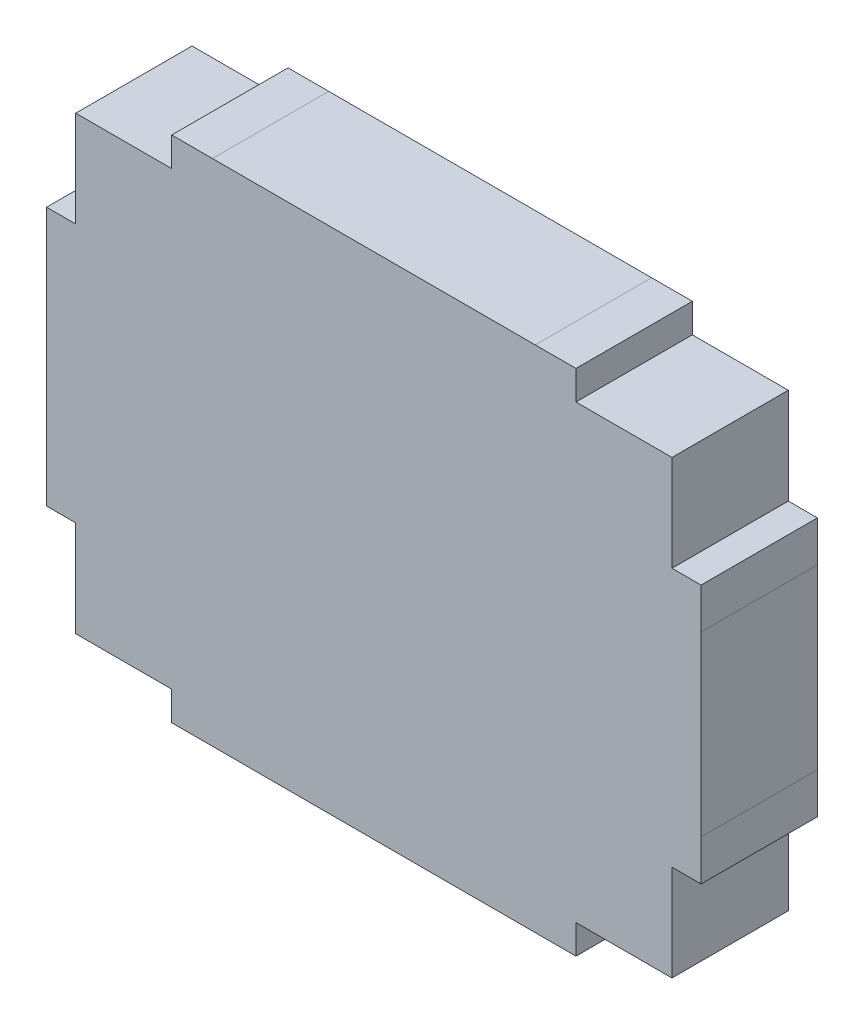
ISO-10303-21;
HEADER;
FILE_DESCRIPTION(('STEP AP214'),'2;1');
FILE_NAME('part.step','',(''),(''),'','','');
FILE_SCHEMA(('AUTOMOTIVE_DESIGN { 1 0 10303 214 1 1 1 1 }'));
ENDSEC;
DATA;
#1=APPLICATION_CONTEXT('core data for automotive mechanical design processes');
#2=APPLICATION_PROTOCOL_DEFINITION('international standard','automotive_design',2000,#1);
#3=PRODUCT_CONTEXT('',#1,'mechanical');
#4=PRODUCT('Part','Part','',(#3));
#5=PRODUCT_RELATED_PRODUCT_CATEGORY('part','',(#4));
#6=PRODUCT_DEFINITION_FORMATION('','',#4);
#7=PRODUCT_DEFINITION_CONTEXT('part definition',#1,'design');
#8=PRODUCT_DEFINITION('design','',#6,#7);
#9=PRODUCT_DEFINITION_SHAPE('','',#8);
#10=(LENGTH_UNIT() NAMED_UNIT(*) SI_UNIT(.MILLI.,.METRE.));
#11=(NAMED_UNIT(*) PLANE_ANGLE_UNIT() SI_UNIT($,.RADIAN.));
#12=(NAMED_UNIT(*) SI_UNIT($,.STERADIAN.) SOLID_ANGLE_UNIT());
#13=UNCERTAINTY_MEASURE_WITH_UNIT(LENGTH_MEASURE(1.E-05),#10,'distance_accuracy_value','');
#14=(GEOMETRIC_REPRESENTATION_CONTEXT(3) GLOBAL_UNCERTAINTY_ASSIGNED_CONTEXT((#13)) GLOBAL_UNIT_ASSIGNED_CONTEXT((#10,
#11,#12)) REPRESENTATION_CONTEXT('',''));
#15=CARTESIAN_POINT('',(0.,0.,0.));
#16=DIRECTION('',(0.,0.,1.));
#17=DIRECTION('',(1.,0.,0.));
#18=AXIS2_PLACEMENT_3D('',#15,#16,#17);
#19=CARTESIAN_POINT('',(0.,0.,0.8));
#20=DIRECTION('',(0.,0.,1.));
#21=DIRECTION('',(1.,0.,0.));
#22=AXIS2_PLACEMENT_3D('',#19,#20,#21);
#23=PLANE('',#22);
#24=DIRECTION('',(1.,0.,0.));
#25=VECTOR('',#24,1.);
#26=CARTESIAN_POINT('',(-1.39,-1.75,0.8));
#27=LINE('',#26,#25);
#28=CARTESIAN_POINT('',(-1.39,-1.75,0.8));
#29=VERTEX_POINT('',#28);
#30=CARTESIAN_POINT('',(-1.11,-1.75,0.8));
#31=VERTEX_POINT('',#30);
#32=EDGE_CURVE('E370',#29,#31,#27,.T.);
#33=ORIENTED_EDGE('',*,*,#32,.T.);
#34=DIRECTION('',(1.,0.,0.));
#35=VECTOR('',#34,1.);
#36=CARTESIAN_POINT('',(-1.11,-1.75,0.8));
#37=LINE('',#36,#35);
#38=CARTESIAN_POINT('',(1.11,-1.75,0.8));
#39=VERTEX_POINT('',#38);
#40=EDGE_CURVE('E11',#31,#39,#37,.T.);
#41=ORIENTED_EDGE('',*,*,#40,.T.);
#42=DIRECTION('',(1.,0.,0.));
#43=VECTOR('',#42,1.);
#44=CARTESIAN_POINT('',(1.11,-1.75,0.8));
#45=LINE('',#44,#43);
#46=CARTESIAN_POINT('',(1.39,-1.75,0.8));
#47=VERTEX_POINT('',#46);
#48=EDGE_CURVE('E505',#39,#47,#45,.T.);
#49=ORIENTED_EDGE('',*,*,#48,.T.);
#50=DIRECTION('',(0.,1.,0.));
#51=VECTOR('',#50,1.);
#52=CARTESIAN_POINT('',(1.39,-1.75,0.8));
#53=LINE('',#52,#51);
#54=CARTESIAN_POINT('',(1.39,-1.55,0.8));
#55=VERTEX_POINT('',#54);
#56=EDGE_CURVE('E351',#47,#55,#53,.T.);
#57=ORIENTED_EDGE('',*,*,#56,.T.);
#58=DIRECTION('',(1.,0.,0.));
#59=VECTOR('',#58,1.);
#60=CARTESIAN_POINT('',(1.39,-1.55,0.8));
#61=LINE('',#60,#59);
#62=CARTESIAN_POINT('',(2.05,-1.55,0.8));
#63=VERTEX_POINT('',#62);
#64=EDGE_CURVE('E472',#55,#63,#61,.T.);
#65=ORIENTED_EDGE('',*,*,#64,.T.);
#66=DIRECTION('',(0.,1.,0.));
#67=VECTOR('',#66,1.);
#68=CARTESIAN_POINT('',(2.05,-1.55,0.8));
#69=LINE('',#68,#67);
#70=CARTESIAN_POINT('',(2.05,-0.89,0.8));
#71=VERTEX_POINT('',#70);
#72=EDGE_CURVE('E455',#63,#71,#69,.T.);
#73=ORIENTED_EDGE('',*,*,#72,.T.);
#74=DIRECTION('',(1.,0.,0.));
#75=VECTOR('',#74,1.);
#76=CARTESIAN_POINT('',(2.05,-0.89,0.8));
#77=LINE('',#76,#75);
#78=CARTESIAN_POINT('',(2.25,-0.89,0.8));
#79=VERTEX_POINT('',#78);
#80=EDGE_CURVE('E331',#71,#79,#77,.T.);
#81=ORIENTED_EDGE('',*,*,#80,.T.);
#82=DIRECTION('',(0.,1.,0.));
#83=VECTOR('',#82,1.);
#84=CARTESIAN_POINT('',(2.25,-0.89,0.8));
#85=LINE('',#84,#83);
#86=CARTESIAN_POINT('',(2.25,-0.61,0.8));
#87=VERTEX_POINT('',#86);
#88=EDGE_CURVE('E332',#79,#87,#85,.T.);
#89=ORIENTED_EDGE('',*,*,#88,.T.);
#90=DIRECTION('',(0.,1.,0.));
#91=VECTOR('',#90,1.);
#92=CARTESIAN_POINT('',(2.25,-0.61,0.8));
#93=LINE('',#92,#91);
#94=CARTESIAN_POINT('',(2.25,0.61,0.8));
#95=VERTEX_POINT('',#94);
#96=EDGE_CURVE('E484',#87,#95,#93,.T.);
#97=ORIENTED_EDGE('',*,*,#96,.T.);
#98=DIRECTION('',(0.,1.,0.));
#99=VECTOR('',#98,1.);
#100=CARTESIAN_POINT('',(2.25,0.61,0.8));
#101=LINE('',#100,#99);
#102=CARTESIAN_POINT('',(2.25,0.89,0.8));
#103=VERTEX_POINT('',#102);
#104=EDGE_CURVE('E304',#95,#103,#101,.T.);
#105=ORIENTED_EDGE('',*,*,#104,.T.);
#106=DIRECTION('',(-1.,0.,0.));
#107=VECTOR('',#106,1.);
#108=CARTESIAN_POINT('',(2.25,0.89,0.8));
#109=LINE('',#108,#107);
#110=CARTESIAN_POINT('',(2.05,0.89,0.8));
#111=VERTEX_POINT('',#110);
#112=EDGE_CURVE('E318',#103,#111,#109,.T.);
#113=ORIENTED_EDGE('',*,*,#112,.T.);
#114=DIRECTION('',(0.,1.,0.));
#115=VECTOR('',#114,1.);
#116=CARTESIAN_POINT('',(2.05,0.89,0.8));
#117=LINE('',#116,#115);
#118=CARTESIAN_POINT('',(2.05,1.55,0.8));
#119=VERTEX_POINT('',#118);
#120=EDGE_CURVE('E410',#111,#119,#117,.T.);
#121=ORIENTED_EDGE('',*,*,#120,.T.);
#122=DIRECTION('',(-1.,0.,0.));
#123=VECTOR('',#122,1.);
#124=CARTESIAN_POINT('',(2.05,1.55,0.8));
#125=LINE('',#124,#123);
#126=CARTESIAN_POINT('',(1.39,1.55,0.8));
#127=VERTEX_POINT('',#126);
#128=EDGE_CURVE('E528',#119,#127,#125,.T.);
#129=ORIENTED_EDGE('',*,*,#128,.T.);
#130=DIRECTION('',(0.,1.,0.));
#131=VECTOR('',#130,1.);
#132=CARTESIAN_POINT('',(1.39,1.55,0.8));
#133=LINE('',#132,#131);
#134=CARTESIAN_POINT('',(1.39,1.75,0.8));
#135=VERTEX_POINT('',#134);
#136=EDGE_CURVE('E430',#127,#135,#133,.T.);
#137=ORIENTED_EDGE('',*,*,#136,.T.);
#138=DIRECTION('',(-1.,0.,0.));
#139=VECTOR('',#138,1.);
#140=CARTESIAN_POINT('',(1.39,1.75,0.8));
#141=LINE('',#140,#139);
#142=CARTESIAN_POINT('',(1.11,1.75,0.8));
#143=VERTEX_POINT('',#142);
#144=EDGE_CURVE('E356',#135,#143,#141,.T.);
#145=ORIENTED_EDGE('',*,*,#144,.T.);
#146=DIRECTION('',(-1.,0.,0.));
#147=VECTOR('',#146,1.);
#148=CARTESIAN_POINT('',(1.11,1.75,0.8));
#149=LINE('',#148,#147);
#150=CARTESIAN_POINT('',(-1.11,1.75,0.8));
#151=VERTEX_POINT('',#150);
#152=EDGE_CURVE('E451',#143,#151,#149,.T.);
#153=ORIENTED_EDGE('',*,*,#152,.T.);
#154=DIRECTION('',(-1.,0.,0.));
#155=VECTOR('',#154,1.);
#156=CARTESIAN_POINT('',(-1.11,1.75,0.8));
#157=LINE('',#156,#155);
#158=CARTESIAN_POINT('',(-1.39,1.75,0.8));
#159=VERTEX_POINT('',#158);
#160=EDGE_CURVE('E450',#151,#159,#157,.T.);
#161=ORIENTED_EDGE('',*,*,#160,.T.);
#162=DIRECTION('',(0.,-1.,0.));
#163=VECTOR('',#162,1.);
#164=CARTESIAN_POINT('',(-1.39,1.75,0.8));
#165=LINE('',#164,#163);
#166=CARTESIAN_POINT('',(-1.39,1.55,0.8));
#167=VERTEX_POINT('',#166);
#168=EDGE_CURVE('E396',#159,#167,#165,.T.);
#169=ORIENTED_EDGE('',*,*,#168,.T.);
#170=DIRECTION('',(-1.,0.,0.));
#171=VECTOR('',#170,1.);
#172=CARTESIAN_POINT('',(-1.39,1.55,0.8));
#173=LINE('',#172,#171);
#174=CARTESIAN_POINT('',(-2.05,1.55,0.8));
#175=VERTEX_POINT('',#174);
#176=EDGE_CURVE('E397',#167,#175,#173,.T.);
#177=ORIENTED_EDGE('',*,*,#176,.T.);
#178=DIRECTION('',(0.,-1.,0.));
#179=VECTOR('',#178,1.);
#180=CARTESIAN_POINT('',(-2.05,1.55,0.8));
#181=LINE('',#180,#179);
#182=CARTESIAN_POINT('',(-2.05,0.89,0.8));
#183=VERTEX_POINT('',#182);
#184=EDGE_CURVE('E383',#175,#183,#181,.T.);
#185=ORIENTED_EDGE('',*,*,#184,.T.);
#186=DIRECTION('',(-1.,0.,0.));
#187=VECTOR('',#186,1.);
#188=CARTESIAN_POINT('',(-2.05,0.89,0.8));
#189=LINE('',#188,#187);
#190=CARTESIAN_POINT('',(-2.25,0.89,0.8));
#191=VERTEX_POINT('',#190);
#192=EDGE_CURVE('E350',#183,#191,#189,.T.);
#193=ORIENTED_EDGE('',*,*,#192,.T.);
#194=DIRECTION('',(0.,-1.,0.));
#195=VECTOR('',#194,1.);
#196=CARTESIAN_POINT('',(-2.25,0.89,0.8));
#197=LINE('',#196,#195);
#198=CARTESIAN_POINT('',(-2.25,0.61,0.8));
#199=VERTEX_POINT('',#198);
#200=EDGE_CURVE('E269',#191,#199,#197,.T.);
#201=ORIENTED_EDGE('',*,*,#200,.T.);
#202=DIRECTION('',(0.,-1.,0.));
#203=VECTOR('',#202,1.);
#204=CARTESIAN_POINT('',(-2.25,0.61,0.8));
#205=LINE('',#204,#203);
#206=CARTESIAN_POINT('',(-2.25,-0.61,0.8));
#207=VERTEX_POINT('',#206);
#208=EDGE_CURVE('E265',#199,#207,#205,.T.);
#209=ORIENTED_EDGE('',*,*,#208,.T.);
#210=DIRECTION('',(0.,-1.,0.));
#211=VECTOR('',#210,1.);
#212=CARTESIAN_POINT('',(-2.25,-0.61,0.8));
#213=LINE('',#212,#211);
#214=CARTESIAN_POINT('',(-2.25,-0.89,0.8));
#215=VERTEX_POINT('',#214);
#216=EDGE_CURVE('E437',#207,#215,#213,.T.);
#217=ORIENTED_EDGE('',*,*,#216,.T.);
#218=DIRECTION('',(1.,0.,0.));
#219=VECTOR('',#218,1.);
#220=CARTESIAN_POINT('',(-2.25,-0.89,0.8));
#221=LINE('',#220,#219);
#222=CARTESIAN_POINT('',(-2.05,-0.89,0.8));
#223=VERTEX_POINT('',#222);
#224=EDGE_CURVE('E460',#215,#223,#221,.T.);
#225=ORIENTED_EDGE('',*,*,#224,.T.);
#226=DIRECTION('',(0.,-1.,0.));
#227=VECTOR('',#226,1.);
#228=CARTESIAN_POINT('',(-2.05,-0.89,0.8));
#229=LINE('',#228,#227);
#230=CARTESIAN_POINT('',(-2.05,-1.55,0.8));
#231=VERTEX_POINT('',#230);
#232=EDGE_CURVE('E335',#223,#231,#229,.T.);
#233=ORIENTED_EDGE('',*,*,#232,.T.);
#234=DIRECTION('',(1.,0.,0.));
#235=VECTOR('',#234,1.);
#236=CARTESIAN_POINT('',(-2.05,-1.55,0.8));
#237=LINE('',#236,#235);
#238=CARTESIAN_POINT('',(-1.39,-1.55,0.8));
#239=VERTEX_POINT('',#238);
#240=EDGE_CURVE('E322',#231,#239,#237,.T.);
#241=ORIENTED_EDGE('',*,*,#240,.T.);
#242=DIRECTION('',(0.,-1.,0.));
#243=VECTOR('',#242,1.);
#244=CARTESIAN_POINT('',(-1.39,-1.55,0.8));
#245=LINE('',#244,#243);
#246=EDGE_CURVE('E416',#239,#29,#245,.T.);
#247=ORIENTED_EDGE('',*,*,#246,.T.);
#248=EDGE_LOOP('',(#33,#41,#49,#57,#65,#73,#81,#89,#97,#105,#113,#121,#129,#137,#145,#153,#161,
#169,#177,#185,#193,#201,#209,#217,#225,#233,#241,#247));
#249=FACE_BOUND('',#248,.T.);
#250=ADVANCED_FACE('F16',(#249),#23,.T.);
#251=CARTESIAN_POINT('',(-1.11,-1.75,0.));
#252=DIRECTION('',(0.,-1.,0.));
#253=DIRECTION('',(0.,0.,-1.));
#254=AXIS2_PLACEMENT_3D('',#251,#252,#253);
#255=PLANE('',#254);
#256=DIRECTION('',(1.,0.,0.));
#257=VECTOR('',#256,1.);
#258=CARTESIAN_POINT('',(-1.11,-1.75,0.));
#259=LINE('',#258,#257);
#260=CARTESIAN_POINT('',(-1.11,-1.75,0.));
#261=VERTEX_POINT('',#260);
#262=CARTESIAN_POINT('',(1.11,-1.75,0.));
#263=VERTEX_POINT('',#262);
#264=EDGE_CURVE('E421',#261,#263,#259,.T.);
#265=ORIENTED_EDGE('',*,*,#264,.T.);
#266=DIRECTION('',(0.,0.,1.));
#267=VECTOR('',#266,1.);
#268=CARTESIAN_POINT('',(1.11,-1.75,0.));
#269=LINE('',#268,#267);
#270=EDGE_CURVE('E27',#263,#39,#269,.T.);
#271=ORIENTED_EDGE('',*,*,#270,.T.);
#272=ORIENTED_EDGE('',*,*,#40,.F.);
#273=DIRECTION('',(0.,0.,1.));
#274=VECTOR('',#273,1.);
#275=CARTESIAN_POINT('',(-1.11,-1.75,0.));
#276=LINE('',#275,#274);
#277=EDGE_CURVE('E374',#261,#31,#276,.T.);
#278=ORIENTED_EDGE('',*,*,#277,.F.);
#279=EDGE_LOOP('',(#265,#271,#272,#278));
#280=FACE_BOUND('',#279,.T.);
#281=ADVANCED_FACE('F598',(#280),#255,.T.);
#282=CARTESIAN_POINT('',(1.11,-1.75,0.));
#283=DIRECTION('',(0.,-1.,0.));
#284=DIRECTION('',(0.,0.,-1.));
#285=AXIS2_PLACEMENT_3D('',#282,#283,#284);
#286=PLANE('',#285);
#287=DIRECTION('',(1.,0.,0.));
#288=VECTOR('',#287,1.);
#289=CARTESIAN_POINT('',(1.11,-1.75,0.));
#290=LINE('',#289,#288);
#291=CARTESIAN_POINT('',(1.39,-1.75,0.));
#292=VERTEX_POINT('',#291);
#293=EDGE_CURVE('E368',#263,#292,#290,.T.);
#294=ORIENTED_EDGE('',*,*,#293,.T.);
#295=DIRECTION('',(0.,0.,1.));
#296=VECTOR('',#295,1.);
#297=CARTESIAN_POINT('',(1.39,-1.75,0.));
#298=LINE('',#297,#296);
#299=EDGE_CURVE('E354',#292,#47,#298,.T.);
#300=ORIENTED_EDGE('',*,*,#299,.T.);
#301=ORIENTED_EDGE('',*,*,#48,.F.);
#302=ORIENTED_EDGE('',*,*,#270,.F.);
#303=EDGE_LOOP('',(#294,#300,#301,#302));
#304=FACE_BOUND('',#303,.T.);
#305=ADVANCED_FACE('F603',(#304),#286,.T.);
#306=CARTESIAN_POINT('',(1.39,-1.75,0.));
#307=DIRECTION('',(1.,0.,0.));
#308=DIRECTION('',(0.,1.,0.));
#309=AXIS2_PLACEMENT_3D('',#306,#307,#308);
#310=PLANE('',#309);
#311=DIRECTION('',(0.,1.,0.));
#312=VECTOR('',#311,1.);
#313=CARTESIAN_POINT('',(1.39,-1.75,0.));
#314=LINE('',#313,#312);
#315=CARTESIAN_POINT('',(1.39,-1.55,0.));
#316=VERTEX_POINT('',#315);
#317=EDGE_CURVE('E364',#292,#316,#314,.T.);
#318=ORIENTED_EDGE('',*,*,#317,.T.);
#319=DIRECTION('',(0.,0.,1.));
#320=VECTOR('',#319,1.);
#321=CARTESIAN_POINT('',(1.39,-1.55,0.));
#322=LINE('',#321,#320);
#323=EDGE_CURVE('E355',#316,#55,#322,.T.);
#324=ORIENTED_EDGE('',*,*,#323,.T.);
#325=ORIENTED_EDGE('',*,*,#56,.F.);
#326=ORIENTED_EDGE('',*,*,#299,.F.);
#327=EDGE_LOOP('',(#318,#324,#325,#326));
#328=FACE_BOUND('',#327,.T.);
#329=ADVANCED_FACE('F638',(#328),#310,.T.);
#330=CARTESIAN_POINT('',(1.39,-1.55,0.));
#331=DIRECTION('',(0.,-1.,0.));
#332=DIRECTION('',(0.,0.,-1.));
#333=AXIS2_PLACEMENT_3D('',#330,#331,#332);
#334=PLANE('',#333);
#335=DIRECTION('',(1.,0.,0.));
#336=VECTOR('',#335,1.);
#337=CARTESIAN_POINT('',(1.39,-1.55,0.));
#338=LINE('',#337,#336);
#339=CARTESIAN_POINT('',(2.05,-1.55,0.));
#340=VERTEX_POINT('',#339);
#341=EDGE_CURVE('E369',#316,#340,#338,.T.);
#342=ORIENTED_EDGE('',*,*,#341,.T.);
#343=DIRECTION('',(0.,0.,1.));
#344=VECTOR('',#343,1.);
#345=CARTESIAN_POINT('',(2.05,-1.55,0.));
#346=LINE('',#345,#344);
#347=EDGE_CURVE('E458',#340,#63,#346,.T.);
#348=ORIENTED_EDGE('',*,*,#347,.T.);
#349=ORIENTED_EDGE('',*,*,#64,.F.);
#350=ORIENTED_EDGE('',*,*,#323,.F.);
#351=EDGE_LOOP('',(#342,#348,#349,#350));
#352=FACE_BOUND('',#351,.T.);
#353=ADVANCED_FACE('F641',(#352),#334,.T.);
#354=CARTESIAN_POINT('',(2.05,-1.55,0.));
#355=DIRECTION('',(1.,0.,0.));
#356=DIRECTION('',(0.,1.,0.));
#357=AXIS2_PLACEMENT_3D('',#354,#355,#356);
#358=PLANE('',#357);
#359=DIRECTION('',(0.,1.,0.));
#360=VECTOR('',#359,1.);
#361=CARTESIAN_POINT('',(2.05,-1.55,0.));
#362=LINE('',#361,#360);
#363=CARTESIAN_POINT('',(2.05,-0.89,0.));
#364=VERTEX_POINT('',#363);
#365=EDGE_CURVE('E436',#340,#364,#362,.T.);
#366=ORIENTED_EDGE('',*,*,#365,.T.);
#367=DIRECTION('',(0.,0.,1.));
#368=VECTOR('',#367,1.);
#369=CARTESIAN_POINT('',(2.05,-0.89,0.));
#370=LINE('',#369,#368);
#371=EDGE_CURVE('E459',#364,#71,#370,.T.);
#372=ORIENTED_EDGE('',*,*,#371,.T.);
#373=ORIENTED_EDGE('',*,*,#72,.F.);
#374=ORIENTED_EDGE('',*,*,#347,.F.);
#375=EDGE_LOOP('',(#366,#372,#373,#374));
#376=FACE_BOUND('',#375,.T.);
#377=ADVANCED_FACE('F703',(#376),#358,.T.);
#378=CARTESIAN_POINT('',(2.05,-0.89,0.));
#379=DIRECTION('',(0.,-1.,0.));
#380=DIRECTION('',(0.,0.,-1.));
#381=AXIS2_PLACEMENT_3D('',#378,#379,#380);
#382=PLANE('',#381);
#383=DIRECTION('',(1.,0.,0.));
#384=VECTOR('',#383,1.);
#385=CARTESIAN_POINT('',(2.05,-0.89,0.));
#386=LINE('',#385,#384);
#387=CARTESIAN_POINT('',(2.25,-0.89,0.));
#388=VERTEX_POINT('',#387);
#389=EDGE_CURVE('E432',#364,#388,#386,.T.);
#390=ORIENTED_EDGE('',*,*,#389,.T.);
#391=DIRECTION('',(0.,0.,1.));
#392=VECTOR('',#391,1.);
#393=CARTESIAN_POINT('',(2.25,-0.89,0.));
#394=LINE('',#393,#392);
#395=EDGE_CURVE('E327',#388,#79,#394,.T.);
#396=ORIENTED_EDGE('',*,*,#395,.T.);
#397=ORIENTED_EDGE('',*,*,#80,.F.);
#398=ORIENTED_EDGE('',*,*,#371,.F.);
#399=EDGE_LOOP('',(#390,#396,#397,#398));
#400=FACE_BOUND('',#399,.T.);
#401=ADVANCED_FACE('F627',(#400),#382,.T.);
#402=CARTESIAN_POINT('',(2.25,-0.89,0.));
#403=DIRECTION('',(1.,0.,0.));
#404=DIRECTION('',(0.,1.,0.));
#405=AXIS2_PLACEMENT_3D('',#402,#403,#404);
#406=PLANE('',#405);
#407=DIRECTION('',(0.,1.,0.));
#408=VECTOR('',#407,1.);
#409=CARTESIAN_POINT('',(2.25,-0.89,0.));
#410=LINE('',#409,#408);
#411=CARTESIAN_POINT('',(2.25,-0.61,0.));
#412=VERTEX_POINT('',#411);
#413=EDGE_CURVE('E316',#388,#412,#410,.T.);
#414=ORIENTED_EDGE('',*,*,#413,.T.);
#415=DIRECTION('',(0.,0.,1.));
#416=VECTOR('',#415,1.);
#417=CARTESIAN_POINT('',(2.25,-0.61,0.));
#418=LINE('',#417,#416);
#419=EDGE_CURVE('E487',#412,#87,#418,.T.);
#420=ORIENTED_EDGE('',*,*,#419,.T.);
#421=ORIENTED_EDGE('',*,*,#88,.F.);
#422=ORIENTED_EDGE('',*,*,#395,.F.);
#423=EDGE_LOOP('',(#414,#420,#421,#422));
#424=FACE_BOUND('',#423,.T.);
#425=ADVANCED_FACE('F623',(#424),#406,.T.);
#426=CARTESIAN_POINT('',(2.25,-0.61,0.));
#427=DIRECTION('',(1.,0.,0.));
#428=DIRECTION('',(0.,1.,0.));
#429=AXIS2_PLACEMENT_3D('',#426,#427,#428);
#430=PLANE('',#429);
#431=DIRECTION('',(0.,1.,0.));
#432=VECTOR('',#431,1.);
#433=CARTESIAN_POINT('',(2.25,-0.61,0.));
#434=LINE('',#433,#432);
#435=CARTESIAN_POINT('',(2.25,0.61,0.));
#436=VERTEX_POINT('',#435);
#437=EDGE_CURVE('E312',#412,#436,#434,.T.);
#438=ORIENTED_EDGE('',*,*,#437,.T.);
#439=DIRECTION('',(0.,0.,1.));
#440=VECTOR('',#439,1.);
#441=CARTESIAN_POINT('',(2.25,0.61,0.));
#442=LINE('',#441,#440);
#443=EDGE_CURVE('E307',#436,#95,#442,.T.);
#444=ORIENTED_EDGE('',*,*,#443,.T.);
#445=ORIENTED_EDGE('',*,*,#96,.F.);
#446=ORIENTED_EDGE('',*,*,#419,.F.);
#447=EDGE_LOOP('',(#438,#444,#445,#446));
#448=FACE_BOUND('',#447,.T.);
#449=ADVANCED_FACE('F626',(#448),#430,.T.);
#450=CARTESIAN_POINT('',(2.25,0.61,0.));
#451=DIRECTION('',(1.,0.,0.));
#452=DIRECTION('',(0.,1.,0.));
#453=AXIS2_PLACEMENT_3D('',#450,#451,#452);
#454=PLANE('',#453);
#455=DIRECTION('',(0.,1.,0.));
#456=VECTOR('',#455,1.);
#457=CARTESIAN_POINT('',(2.25,0.61,0.));
#458=LINE('',#457,#456);
#459=CARTESIAN_POINT('',(2.25,0.89,0.));
#460=VERTEX_POINT('',#459);
#461=EDGE_CURVE('E317',#436,#460,#458,.T.);
#462=ORIENTED_EDGE('',*,*,#461,.T.);
#463=DIRECTION('',(0.,0.,1.));
#464=VECTOR('',#463,1.);
#465=CARTESIAN_POINT('',(2.25,0.89,0.));
#466=LINE('',#465,#464);
#467=EDGE_CURVE('E308',#460,#103,#466,.T.);
#468=ORIENTED_EDGE('',*,*,#467,.T.);
#469=ORIENTED_EDGE('',*,*,#104,.F.);
#470=ORIENTED_EDGE('',*,*,#443,.F.);
#471=EDGE_LOOP('',(#462,#468,#469,#470));
#472=FACE_BOUND('',#471,.T.);
#473=ADVANCED_FACE('F692',(#472),#454,.T.);
#474=CARTESIAN_POINT('',(2.25,0.89,0.));
#475=DIRECTION('',(0.,1.,0.));
#476=DIRECTION('',(1.,0.,0.));
#477=AXIS2_PLACEMENT_3D('',#474,#475,#476);
#478=PLANE('',#477);
#479=DIRECTION('',(-1.,0.,0.));
#480=VECTOR('',#479,1.);
#481=CARTESIAN_POINT('',(2.25,0.89,0.));
#482=LINE('',#481,#480);
#483=CARTESIAN_POINT('',(2.05,0.89,0.));
#484=VERTEX_POINT('',#483);
#485=EDGE_CURVE('E341',#460,#484,#482,.T.);
#486=ORIENTED_EDGE('',*,*,#485,.T.);
#487=DIRECTION('',(0.,0.,1.));
#488=VECTOR('',#487,1.);
#489=CARTESIAN_POINT('',(2.05,0.89,0.));
#490=LINE('',#489,#488);
#491=EDGE_CURVE('E321',#484,#111,#490,.T.);
#492=ORIENTED_EDGE('',*,*,#491,.T.);
#493=ORIENTED_EDGE('',*,*,#112,.F.);
#494=ORIENTED_EDGE('',*,*,#467,.F.);
#495=EDGE_LOOP('',(#486,#492,#493,#494));
#496=FACE_BOUND('',#495,.T.);
#497=ADVANCED_FACE('F592',(#496),#478,.T.);
#498=CARTESIAN_POINT('',(2.05,0.89,0.));
#499=DIRECTION('',(1.,0.,0.));
#500=DIRECTION('',(0.,1.,0.));
#501=AXIS2_PLACEMENT_3D('',#498,#499,#500);
#502=PLANE('',#501);
#503=DIRECTION('',(0.,1.,0.));
#504=VECTOR('',#503,1.);
#505=CARTESIAN_POINT('',(2.05,0.89,0.));
#506=LINE('',#505,#504);
#507=CARTESIAN_POINT('',(2.05,1.55,0.));
#508=VERTEX_POINT('',#507);
#509=EDGE_CURVE('E337',#484,#508,#506,.T.);
#510=ORIENTED_EDGE('',*,*,#509,.T.);
#511=DIRECTION('',(0.,0.,1.));
#512=VECTOR('',#511,1.);
#513=CARTESIAN_POINT('',(2.05,1.55,0.));
#514=LINE('',#513,#512);
#515=EDGE_CURVE('E413',#508,#119,#514,.T.);
#516=ORIENTED_EDGE('',*,*,#515,.T.);
#517=ORIENTED_EDGE('',*,*,#120,.F.);
#518=ORIENTED_EDGE('',*,*,#491,.F.);
#519=EDGE_LOOP('',(#510,#516,#517,#518));
#520=FACE_BOUND('',#519,.T.);
#521=ADVANCED_FACE('F584',(#520),#502,.T.);
#522=CARTESIAN_POINT('',(2.05,1.55,0.));
#523=DIRECTION('',(0.,1.,0.));
#524=DIRECTION('',(1.,0.,0.));
#525=AXIS2_PLACEMENT_3D('',#522,#523,#524);
#526=PLANE('',#525);
#527=DIRECTION('',(-1.,0.,0.));
#528=VECTOR('',#527,1.);
#529=CARTESIAN_POINT('',(2.05,1.55,0.));
#530=LINE('',#529,#528);
#531=CARTESIAN_POINT('',(1.39,1.55,0.));
#532=VERTEX_POINT('',#531);
#533=EDGE_CURVE('E342',#508,#532,#530,.T.);
#534=ORIENTED_EDGE('',*,*,#533,.T.);
#535=DIRECTION('',(0.,0.,1.));
#536=VECTOR('',#535,1.);
#537=CARTESIAN_POINT('',(1.39,1.55,0.));
#538=LINE('',#537,#536);
#539=EDGE_CURVE('E444',#532,#127,#538,.T.);
#540=ORIENTED_EDGE('',*,*,#539,.T.);
#541=ORIENTED_EDGE('',*,*,#128,.F.);
#542=ORIENTED_EDGE('',*,*,#515,.F.);
#543=EDGE_LOOP('',(#534,#540,#541,#542));
#544=FACE_BOUND('',#543,.T.);
#545=ADVANCED_FACE('F582',(#544),#526,.T.);
#546=CARTESIAN_POINT('',(1.39,1.55,0.));
#547=DIRECTION('',(1.,0.,0.));
#548=DIRECTION('',(0.,1.,0.));
#549=AXIS2_PLACEMENT_3D('',#546,#547,#548);
#550=PLANE('',#549);
#551=DIRECTION('',(0.,1.,0.));
#552=VECTOR('',#551,1.);
#553=CARTESIAN_POINT('',(1.39,1.55,0.));
#554=LINE('',#553,#552);
#555=CARTESIAN_POINT('',(1.39,1.75,0.));
#556=VERTEX_POINT('',#555);
#557=EDGE_CURVE('E20',#532,#556,#554,.T.);
#558=ORIENTED_EDGE('',*,*,#557,.T.);
#559=DIRECTION('',(0.,0.,1.));
#560=VECTOR('',#559,1.);
#561=CARTESIAN_POINT('',(1.39,1.75,0.));
#562=LINE('',#561,#560);
#563=EDGE_CURVE('E359',#556,#135,#562,.T.);
#564=ORIENTED_EDGE('',*,*,#563,.T.);
#565=ORIENTED_EDGE('',*,*,#136,.F.);
#566=ORIENTED_EDGE('',*,*,#539,.F.);
#567=EDGE_LOOP('',(#558,#564,#565,#566));
#568=FACE_BOUND('',#567,.T.);
#569=ADVANCED_FACE('F571',(#568),#550,.T.);
#570=CARTESIAN_POINT('',(1.39,1.75,0.));
#571=DIRECTION('',(0.,1.,0.));
#572=DIRECTION('',(1.,0.,0.));
#573=AXIS2_PLACEMENT_3D('',#570,#571,#572);
#574=PLANE('',#573);
#575=DIRECTION('',(-1.,0.,0.));
#576=VECTOR('',#575,1.);
#577=CARTESIAN_POINT('',(1.39,1.75,0.));
#578=LINE('',#577,#576);
#579=CARTESIAN_POINT('',(1.11,1.75,0.));
#580=VERTEX_POINT('',#579);
#581=EDGE_CURVE('E343',#556,#580,#578,.T.);
#582=ORIENTED_EDGE('',*,*,#581,.T.);
#583=DIRECTION('',(0.,0.,1.));
#584=VECTOR('',#583,1.);
#585=CARTESIAN_POINT('',(1.11,1.75,0.));
#586=LINE('',#585,#584);
#587=EDGE_CURVE('E360',#580,#143,#586,.T.);
#588=ORIENTED_EDGE('',*,*,#587,.T.);
#589=ORIENTED_EDGE('',*,*,#144,.F.);
#590=ORIENTED_EDGE('',*,*,#563,.F.);
#591=EDGE_LOOP('',(#582,#588,#589,#590));
#592=FACE_BOUND('',#591,.T.);
#593=ADVANCED_FACE('F577',(#592),#574,.T.);
#594=CARTESIAN_POINT('',(1.11,1.75,0.));
#595=DIRECTION('',(0.,1.,0.));
#596=DIRECTION('',(1.,0.,0.));
#597=AXIS2_PLACEMENT_3D('',#594,#595,#596);
#598=PLANE('',#597);
#599=DIRECTION('',(-1.,0.,0.));
#600=VECTOR('',#599,1.);
#601=CARTESIAN_POINT('',(1.11,1.75,0.));
#602=LINE('',#601,#600);
#603=CARTESIAN_POINT('',(-1.11,1.75,0.));
#604=VERTEX_POINT('',#603);
#605=EDGE_CURVE('E347',#580,#604,#602,.T.);
#606=ORIENTED_EDGE('',*,*,#605,.T.);
#607=DIRECTION('',(0.,0.,1.));
#608=VECTOR('',#607,1.);
#609=CARTESIAN_POINT('',(-1.11,1.75,0.));
#610=LINE('',#609,#608);
#611=EDGE_CURVE('E454',#604,#151,#610,.T.);
#612=ORIENTED_EDGE('',*,*,#611,.T.);
#613=ORIENTED_EDGE('',*,*,#152,.F.);
#614=ORIENTED_EDGE('',*,*,#587,.F.);
#615=EDGE_LOOP('',(#606,#612,#613,#614));
#616=FACE_BOUND('',#615,.T.);
#617=ADVANCED_FACE('F611',(#616),#598,.T.);
#618=CARTESIAN_POINT('',(-1.11,1.75,0.));
#619=DIRECTION('',(0.,1.,0.));
#620=DIRECTION('',(1.,0.,0.));
#621=AXIS2_PLACEMENT_3D('',#618,#619,#620);
#622=PLANE('',#621);
#623=DIRECTION('',(-1.,0.,0.));
#624=VECTOR('',#623,1.);
#625=CARTESIAN_POINT('',(-1.11,1.75,0.));
#626=LINE('',#625,#624);
#627=CARTESIAN_POINT('',(-1.39,1.75,0.));
#628=VERTEX_POINT('',#627);
#629=EDGE_CURVE('E297',#604,#628,#626,.T.);
#630=ORIENTED_EDGE('',*,*,#629,.T.);
#631=DIRECTION('',(0.,0.,1.));
#632=VECTOR('',#631,1.);
#633=CARTESIAN_POINT('',(-1.39,1.75,0.));
#634=LINE('',#633,#632);
#635=EDGE_CURVE('E403',#628,#159,#634,.T.);
#636=ORIENTED_EDGE('',*,*,#635,.T.);
#637=ORIENTED_EDGE('',*,*,#160,.F.);
#638=ORIENTED_EDGE('',*,*,#611,.F.);
#639=EDGE_LOOP('',(#630,#636,#637,#638));
#640=FACE_BOUND('',#639,.T.);
#641=ADVANCED_FACE('F612',(#640),#622,.T.);
#642=CARTESIAN_POINT('',(-1.39,1.75,0.));
#643=DIRECTION('',(-1.,0.,0.));
#644=DIRECTION('',(0.,0.,1.));
#645=AXIS2_PLACEMENT_3D('',#642,#643,#644);
#646=PLANE('',#645);
#647=DIRECTION('',(0.,-1.,0.));
#648=VECTOR('',#647,1.);
#649=CARTESIAN_POINT('',(-1.39,1.75,0.));
#650=LINE('',#649,#648);
#651=CARTESIAN_POINT('',(-1.39,1.55,0.));
#652=VERTEX_POINT('',#651);
#653=EDGE_CURVE('E388',#628,#652,#650,.T.);
#654=ORIENTED_EDGE('',*,*,#653,.T.);
#655=DIRECTION('',(0.,0.,1.));
#656=VECTOR('',#655,1.);
#657=CARTESIAN_POINT('',(-1.39,1.55,0.));
#658=LINE('',#657,#656);
#659=EDGE_CURVE('E392',#652,#167,#658,.T.);
#660=ORIENTED_EDGE('',*,*,#659,.T.);
#661=ORIENTED_EDGE('',*,*,#168,.F.);
#662=ORIENTED_EDGE('',*,*,#635,.F.);
#663=EDGE_LOOP('',(#654,#660,#661,#662));
#664=FACE_BOUND('',#663,.T.);
#665=ADVANCED_FACE('F615',(#664),#646,.T.);
#666=CARTESIAN_POINT('',(-1.39,1.55,0.));
#667=DIRECTION('',(0.,1.,0.));
#668=DIRECTION('',(1.,0.,0.));
#669=AXIS2_PLACEMENT_3D('',#666,#667,#668);
#670=PLANE('',#669);
#671=DIRECTION('',(-1.,0.,0.));
#672=VECTOR('',#671,1.);
#673=CARTESIAN_POINT('',(-1.39,1.55,0.));
#674=LINE('',#673,#672);
#675=CARTESIAN_POINT('',(-2.05,1.55,0.));
#676=VERTEX_POINT('',#675);
#677=EDGE_CURVE('E384',#652,#676,#674,.T.);
#678=ORIENTED_EDGE('',*,*,#677,.T.);
#679=DIRECTION('',(0.,0.,1.));
#680=VECTOR('',#679,1.);
#681=CARTESIAN_POINT('',(-2.05,1.55,0.));
#682=LINE('',#681,#680);
#683=EDGE_CURVE('E409',#676,#175,#682,.T.);
#684=ORIENTED_EDGE('',*,*,#683,.T.);
#685=ORIENTED_EDGE('',*,*,#176,.F.);
#686=ORIENTED_EDGE('',*,*,#659,.F.);
#687=EDGE_LOOP('',(#678,#684,#685,#686));
#688=FACE_BOUND('',#687,.T.);
#689=ADVANCED_FACE('F18',(#688),#670,.T.);
#690=CARTESIAN_POINT('',(-2.05,1.55,0.));
#691=DIRECTION('',(-1.,0.,0.));
#692=DIRECTION('',(0.,0.,1.));
#693=AXIS2_PLACEMENT_3D('',#690,#691,#692);
#694=PLANE('',#693);
#695=DIRECTION('',(0.,-1.,0.));
#696=VECTOR('',#695,1.);
#697=CARTESIAN_POINT('',(-2.05,1.55,0.));
#698=LINE('',#697,#696);
#699=CARTESIAN_POINT('',(-2.05,0.89,0.));
#700=VERTEX_POINT('',#699);
#701=EDGE_CURVE('E311',#676,#700,#698,.T.);
#702=ORIENTED_EDGE('',*,*,#701,.T.);
#703=DIRECTION('',(0.,0.,1.));
#704=VECTOR('',#703,1.);
#705=CARTESIAN_POINT('',(-2.05,0.89,0.));
#706=LINE('',#705,#704);
#707=EDGE_CURVE('E379',#700,#183,#706,.T.);
#708=ORIENTED_EDGE('',*,*,#707,.T.);
#709=ORIENTED_EDGE('',*,*,#184,.F.);
#710=ORIENTED_EDGE('',*,*,#683,.F.);
#711=EDGE_LOOP('',(#702,#708,#709,#710));
#712=FACE_BOUND('',#711,.T.);
#713=ADVANCED_FACE('F670',(#712),#694,.T.);
#714=CARTESIAN_POINT('',(-2.05,0.89,0.));
#715=DIRECTION('',(0.,1.,0.));
#716=DIRECTION('',(1.,0.,0.));
#717=AXIS2_PLACEMENT_3D('',#714,#715,#716);
#718=PLANE('',#717);
#719=DIRECTION('',(-1.,0.,0.));
#720=VECTOR('',#719,1.);
#721=CARTESIAN_POINT('',(-2.05,0.89,0.));
#722=LINE('',#721,#720);
#723=CARTESIAN_POINT('',(-2.25,0.89,0.));
#724=VERTEX_POINT('',#723);
#725=EDGE_CURVE('E280',#700,#724,#722,.T.);
#726=ORIENTED_EDGE('',*,*,#725,.T.);
#727=DIRECTION('',(0.,0.,1.));
#728=VECTOR('',#727,1.);
#729=CARTESIAN_POINT('',(-2.25,0.89,0.));
#730=LINE('',#729,#728);
#731=EDGE_CURVE('E275',#724,#191,#730,.T.);
#732=ORIENTED_EDGE('',*,*,#731,.T.);
#733=ORIENTED_EDGE('',*,*,#192,.F.);
#734=ORIENTED_EDGE('',*,*,#707,.F.);
#735=EDGE_LOOP('',(#726,#732,#733,#734));
#736=FACE_BOUND('',#735,.T.);
#737=ADVANCED_FACE('F664',(#736),#718,.T.);
#738=CARTESIAN_POINT('',(-2.25,0.89,0.));
#739=DIRECTION('',(-1.,0.,0.));
#740=DIRECTION('',(0.,0.,1.));
#741=AXIS2_PLACEMENT_3D('',#738,#739,#740);
#742=PLANE('',#741);
#743=DIRECTION('',(0.,-1.,0.));
#744=VECTOR('',#743,1.);
#745=CARTESIAN_POINT('',(-2.25,0.89,0.));
#746=LINE('',#745,#744);
#747=CARTESIAN_POINT('',(-2.25,0.61,0.));
#748=VERTEX_POINT('',#747);
#749=EDGE_CURVE('E272',#724,#748,#746,.T.);
#750=ORIENTED_EDGE('',*,*,#749,.T.);
#751=DIRECTION('',(0.,0.,1.));
#752=VECTOR('',#751,1.);
#753=CARTESIAN_POINT('',(-2.25,0.61,0.));
#754=LINE('',#753,#752);
#755=EDGE_CURVE('E258',#748,#199,#754,.T.);
#756=ORIENTED_EDGE('',*,*,#755,.T.);
#757=ORIENTED_EDGE('',*,*,#200,.F.);
#758=ORIENTED_EDGE('',*,*,#731,.F.);
#759=EDGE_LOOP('',(#750,#756,#757,#758));
#760=FACE_BOUND('',#759,.T.);
#761=ADVANCED_FACE('F273',(#760),#742,.T.);
#762=CARTESIAN_POINT('',(-2.25,0.61,0.));
#763=DIRECTION('',(-1.,0.,0.));
#764=DIRECTION('',(0.,0.,1.));
#765=AXIS2_PLACEMENT_3D('',#762,#763,#764);
#766=PLANE('',#765);
#767=DIRECTION('',(0.,-1.,0.));
#768=VECTOR('',#767,1.);
#769=CARTESIAN_POINT('',(-2.25,0.61,0.));
#770=LINE('',#769,#768);
#771=CARTESIAN_POINT('',(-2.25,-0.61,0.));
#772=VERTEX_POINT('',#771);
#773=EDGE_CURVE('E263',#748,#772,#770,.T.);
#774=ORIENTED_EDGE('',*,*,#773,.T.);
#775=DIRECTION('',(0.,0.,1.));
#776=VECTOR('',#775,1.);
#777=CARTESIAN_POINT('',(-2.25,-0.61,0.));
#778=LINE('',#777,#776);
#779=EDGE_CURVE('E440',#772,#207,#778,.T.);
#780=ORIENTED_EDGE('',*,*,#779,.T.);
#781=ORIENTED_EDGE('',*,*,#208,.F.);
#782=ORIENTED_EDGE('',*,*,#755,.F.);
#783=EDGE_LOOP('',(#774,#780,#781,#782));
#784=FACE_BOUND('',#783,.T.);
#785=ADVANCED_FACE('F260',(#784),#766,.T.);
#786=CARTESIAN_POINT('',(-2.25,-0.61,0.));
#787=DIRECTION('',(-1.,0.,0.));
#788=DIRECTION('',(0.,0.,1.));
#789=AXIS2_PLACEMENT_3D('',#786,#787,#788);
#790=PLANE('',#789);
#791=DIRECTION('',(0.,-1.,0.));
#792=VECTOR('',#791,1.);
#793=CARTESIAN_POINT('',(-2.25,-0.61,0.));
#794=LINE('',#793,#792);
#795=CARTESIAN_POINT('',(-2.25,-0.89,0.));
#796=VERTEX_POINT('',#795);
#797=EDGE_CURVE('E286',#772,#796,#794,.T.);
#798=ORIENTED_EDGE('',*,*,#797,.T.);
#799=DIRECTION('',(0.,0.,1.));
#800=VECTOR('',#799,1.);
#801=CARTESIAN_POINT('',(-2.25,-0.89,0.));
#802=LINE('',#801,#800);
#803=EDGE_CURVE('E441',#796,#215,#802,.T.);
#804=ORIENTED_EDGE('',*,*,#803,.T.);
#805=ORIENTED_EDGE('',*,*,#216,.F.);
#806=ORIENTED_EDGE('',*,*,#779,.F.);
#807=EDGE_LOOP('',(#798,#804,#805,#806));
#808=FACE_BOUND('',#807,.T.);
#809=ADVANCED_FACE('F633',(#808),#790,.T.);
#810=CARTESIAN_POINT('',(-2.25,-0.89,0.));
#811=DIRECTION('',(0.,-1.,0.));
#812=DIRECTION('',(0.,0.,-1.));
#813=AXIS2_PLACEMENT_3D('',#810,#811,#812);
#814=PLANE('',#813);
#815=DIRECTION('',(1.,0.,0.));
#816=VECTOR('',#815,1.);
#817=CARTESIAN_POINT('',(-2.25,-0.89,0.));
#818=LINE('',#817,#816);
#819=CARTESIAN_POINT('',(-2.05,-0.89,0.));
#820=VERTEX_POINT('',#819);
#821=EDGE_CURVE('E293',#796,#820,#818,.T.);
#822=ORIENTED_EDGE('',*,*,#821,.T.);
#823=DIRECTION('',(0.,0.,1.));
#824=VECTOR('',#823,1.);
#825=CARTESIAN_POINT('',(-2.05,-0.89,0.));
#826=LINE('',#825,#824);
#827=EDGE_CURVE('E427',#820,#223,#826,.T.);
#828=ORIENTED_EDGE('',*,*,#827,.T.);
#829=ORIENTED_EDGE('',*,*,#224,.F.);
#830=ORIENTED_EDGE('',*,*,#803,.F.);
#831=EDGE_LOOP('',(#822,#828,#829,#830));
#832=FACE_BOUND('',#831,.T.);
#833=ADVANCED_FACE('F636',(#832),#814,.T.);
#834=CARTESIAN_POINT('',(-2.05,-0.89,0.));
#835=DIRECTION('',(-1.,0.,0.));
#836=DIRECTION('',(0.,0.,1.));
#837=AXIS2_PLACEMENT_3D('',#834,#835,#836);
#838=PLANE('',#837);
#839=DIRECTION('',(0.,-1.,0.));
#840=VECTOR('',#839,1.);
#841=CARTESIAN_POINT('',(-2.05,-0.89,0.));
#842=LINE('',#841,#840);
#843=CARTESIAN_POINT('',(-2.05,-1.55,0.));
#844=VERTEX_POINT('',#843);
#845=EDGE_CURVE('E378',#820,#844,#842,.T.);
#846=ORIENTED_EDGE('',*,*,#845,.T.);
#847=DIRECTION('',(0.,0.,1.));
#848=VECTOR('',#847,1.);
#849=CARTESIAN_POINT('',(-2.05,-1.55,0.));
#850=LINE('',#849,#848);
#851=EDGE_CURVE('E325',#844,#231,#850,.T.);
#852=ORIENTED_EDGE('',*,*,#851,.T.);
#853=ORIENTED_EDGE('',*,*,#232,.F.);
#854=ORIENTED_EDGE('',*,*,#827,.F.);
#855=EDGE_LOOP('',(#846,#852,#853,#854));
#856=FACE_BOUND('',#855,.T.);
#857=ADVANCED_FACE('F621',(#856),#838,.T.);
#858=CARTESIAN_POINT('',(-2.05,-1.55,0.));
#859=DIRECTION('',(0.,-1.,0.));
#860=DIRECTION('',(0.,0.,-1.));
#861=AXIS2_PLACEMENT_3D('',#858,#859,#860);
#862=PLANE('',#861);
#863=DIRECTION('',(1.,0.,0.));
#864=VECTOR('',#863,1.);
#865=CARTESIAN_POINT('',(-2.05,-1.55,0.));
#866=LINE('',#865,#864);
#867=CARTESIAN_POINT('',(-1.39,-1.55,0.));
#868=VERTEX_POINT('',#867);
#869=EDGE_CURVE('E302',#844,#868,#866,.T.);
#870=ORIENTED_EDGE('',*,*,#869,.T.);
#871=DIRECTION('',(0.,0.,1.));
#872=VECTOR('',#871,1.);
#873=CARTESIAN_POINT('',(-1.39,-1.55,0.));
#874=LINE('',#873,#872);
#875=EDGE_CURVE('E326',#868,#239,#874,.T.);
#876=ORIENTED_EDGE('',*,*,#875,.T.);
#877=ORIENTED_EDGE('',*,*,#240,.F.);
#878=ORIENTED_EDGE('',*,*,#851,.F.);
#879=EDGE_LOOP('',(#870,#876,#877,#878));
#880=FACE_BOUND('',#879,.T.);
#881=ADVANCED_FACE('F617',(#880),#862,.T.);
#882=CARTESIAN_POINT('',(-1.39,-1.55,0.));
#883=DIRECTION('',(-1.,0.,0.));
#884=DIRECTION('',(0.,0.,1.));
#885=AXIS2_PLACEMENT_3D('',#882,#883,#884);
#886=PLANE('',#885);
#887=DIRECTION('',(0.,-1.,0.));
#888=VECTOR('',#887,1.);
#889=CARTESIAN_POINT('',(-1.39,-1.55,0.));
#890=LINE('',#889,#888);
#891=CARTESIAN_POINT('',(-1.39,-1.75,0.));
#892=VERTEX_POINT('',#891);
#893=EDGE_CURVE('E299',#868,#892,#890,.T.);
#894=ORIENTED_EDGE('',*,*,#893,.T.);
#895=DIRECTION('',(0.,0.,1.));
#896=VECTOR('',#895,1.);
#897=CARTESIAN_POINT('',(-1.39,-1.75,0.));
#898=LINE('',#897,#896);
#899=EDGE_CURVE('E373',#892,#29,#898,.T.);
#900=ORIENTED_EDGE('',*,*,#899,.T.);
#901=ORIENTED_EDGE('',*,*,#246,.F.);
#902=ORIENTED_EDGE('',*,*,#875,.F.);
#903=EDGE_LOOP('',(#894,#900,#901,#902));
#904=FACE_BOUND('',#903,.T.);
#905=ADVANCED_FACE('F620',(#904),#886,.T.);
#906=CARTESIAN_POINT('',(-1.39,-1.75,0.));
#907=DIRECTION('',(0.,-1.,0.));
#908=DIRECTION('',(0.,0.,-1.));
#909=AXIS2_PLACEMENT_3D('',#906,#907,#908);
#910=PLANE('',#909);
#911=DIRECTION('',(1.,0.,0.));
#912=VECTOR('',#911,1.);
#913=CARTESIAN_POINT('',(-1.39,-1.75,0.));
#914=LINE('',#913,#912);
#915=EDGE_CURVE('E303',#892,#261,#914,.T.);
#916=ORIENTED_EDGE('',*,*,#915,.T.);
#917=ORIENTED_EDGE('',*,*,#277,.T.);
#918=ORIENTED_EDGE('',*,*,#32,.F.);
#919=ORIENTED_EDGE('',*,*,#899,.F.);
#920=EDGE_LOOP('',(#916,#917,#918,#919));
#921=FACE_BOUND('',#920,.T.);
#922=ADVANCED_FACE('F631',(#921),#910,.T.);
#923=CARTESIAN_POINT('',(0.,0.,0.));
#924=DIRECTION('',(0.,0.,1.));
#925=DIRECTION('',(1.,0.,0.));
#926=AXIS2_PLACEMENT_3D('',#923,#924,#925);
#927=PLANE('',#926);
#928=ORIENTED_EDGE('',*,*,#915,.F.);
#929=ORIENTED_EDGE('',*,*,#893,.F.);
#930=ORIENTED_EDGE('',*,*,#869,.F.);
#931=ORIENTED_EDGE('',*,*,#845,.F.);
#932=ORIENTED_EDGE('',*,*,#821,.F.);
#933=ORIENTED_EDGE('',*,*,#797,.F.);
#934=ORIENTED_EDGE('',*,*,#773,.F.);
#935=ORIENTED_EDGE('',*,*,#749,.F.);
#936=ORIENTED_EDGE('',*,*,#725,.F.);
#937=ORIENTED_EDGE('',*,*,#701,.F.);
#938=ORIENTED_EDGE('',*,*,#677,.F.);
#939=ORIENTED_EDGE('',*,*,#653,.F.);
#940=ORIENTED_EDGE('',*,*,#629,.F.);
#941=ORIENTED_EDGE('',*,*,#605,.F.);
#942=ORIENTED_EDGE('',*,*,#581,.F.);
#943=ORIENTED_EDGE('',*,*,#557,.F.);
#944=ORIENTED_EDGE('',*,*,#533,.F.);
#945=ORIENTED_EDGE('',*,*,#509,.F.);
#946=ORIENTED_EDGE('',*,*,#485,.F.);
#947=ORIENTED_EDGE('',*,*,#461,.F.);
#948=ORIENTED_EDGE('',*,*,#437,.F.);
#949=ORIENTED_EDGE('',*,*,#413,.F.);
#950=ORIENTED_EDGE('',*,*,#389,.F.);
#951=ORIENTED_EDGE('',*,*,#365,.F.);
#952=ORIENTED_EDGE('',*,*,#341,.F.);
#953=ORIENTED_EDGE('',*,*,#317,.F.);
#954=ORIENTED_EDGE('',*,*,#293,.F.);
#955=ORIENTED_EDGE('',*,*,#264,.F.);
#956=EDGE_LOOP('',(#928,#929,#930,#931,#932,#933,#934,#935,#936,#937,#938,#939,#940,#941,#942,
#943,#944,#945,#946,#947,#948,#949,#950,#951,#952,#953,#954,#955));
#957=FACE_BOUND('',#956,.T.);
#958=ADVANCED_FACE('F283',(#957),#927,.F.);
#959=CLOSED_SHELL('',(#250,#281,#305,#329,#353,#377,#401,#425,#449,#473,#497,#521,#545,#569,
#593,#617,#641,#665,#689,#713,#737,#761,#785,#809,#833,#857,#881,#905,#922,#958));
#960=MANIFOLD_SOLID_BREP('B1',#959);
#961=ADVANCED_BREP_SHAPE_REPRESENTATION('',(#18,#960),#14);
#962=SHAPE_DEFINITION_REPRESENTATION(#9,#961);
ENDSEC;
END-ISO-10303-21;
